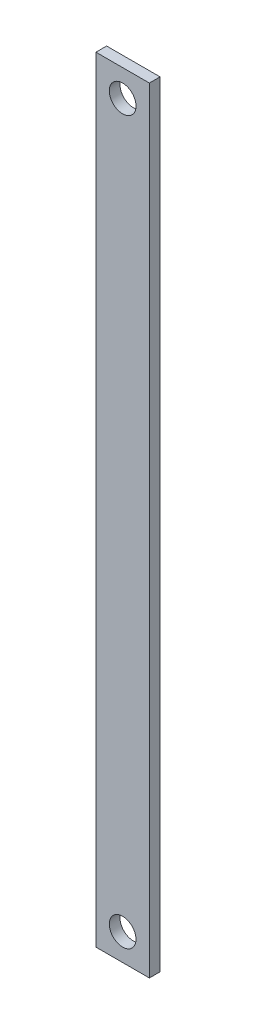
ISO-10303-21;
HEADER;
FILE_DESCRIPTION(('STEP AP214'),'2;1');
FILE_NAME('part.step','',(''),(''),'','','');
FILE_SCHEMA(('AUTOMOTIVE_DESIGN { 1 0 10303 214 1 1 1 1 }'));
ENDSEC;
DATA;
#1=APPLICATION_CONTEXT('core data for automotive mechanical design processes');
#2=APPLICATION_PROTOCOL_DEFINITION('international standard','automotive_design',2000,#1);
#3=PRODUCT_CONTEXT('',#1,'mechanical');
#4=PRODUCT('Part','Part','',(#3));
#5=PRODUCT_RELATED_PRODUCT_CATEGORY('part','',(#4));
#6=PRODUCT_DEFINITION_FORMATION('','',#4);
#7=PRODUCT_DEFINITION_CONTEXT('part definition',#1,'design');
#8=PRODUCT_DEFINITION('design','',#6,#7);
#9=PRODUCT_DEFINITION_SHAPE('','',#8);
#10=(LENGTH_UNIT() NAMED_UNIT(*) SI_UNIT(.MILLI.,.METRE.));
#11=(NAMED_UNIT(*) PLANE_ANGLE_UNIT() SI_UNIT($,.RADIAN.));
#12=(NAMED_UNIT(*) SI_UNIT($,.STERADIAN.) SOLID_ANGLE_UNIT());
#13=UNCERTAINTY_MEASURE_WITH_UNIT(LENGTH_MEASURE(1.E-05),#10,'distance_accuracy_value','');
#14=(GEOMETRIC_REPRESENTATION_CONTEXT(3) GLOBAL_UNCERTAINTY_ASSIGNED_CONTEXT((#13)) GLOBAL_UNIT_ASSIGNED_CONTEXT((#10,
#11,#12)) REPRESENTATION_CONTEXT('',''));
#15=CARTESIAN_POINT('',(0.,0.,0.));
#16=DIRECTION('',(0.,0.,1.));
#17=DIRECTION('',(1.,0.,0.));
#18=AXIS2_PLACEMENT_3D('',#15,#16,#17);
#19=CARTESIAN_POINT('',(0.,290.,0.));
#20=DIRECTION('',(1.,0.,0.));
#21=DIRECTION('',(0.,0.,-1.));
#22=AXIS2_PLACEMENT_3D('',#19,#20,#21);
#23=PLANE('',#22);
#24=DIRECTION('',(0.,0.,1.));
#25=VECTOR('',#24,1.);
#26=CARTESIAN_POINT('',(0.,0.,0.));
#27=LINE('',#26,#25);
#28=CARTESIAN_POINT('',(0.,0.,-4.));
#29=VERTEX_POINT('',#28);
#30=CARTESIAN_POINT('',(0.,0.,0.));
#31=VERTEX_POINT('',#30);
#32=EDGE_CURVE('E97',#29,#31,#27,.T.);
#33=ORIENTED_EDGE('',*,*,#32,.T.);
#34=DIRECTION('',(0.,-1.,0.));
#35=VECTOR('',#34,1.);
#36=CARTESIAN_POINT('',(0.,290.,0.));
#37=LINE('',#36,#35);
#38=CARTESIAN_POINT('',(0.,290.,0.));
#39=VERTEX_POINT('',#38);
#40=EDGE_CURVE('E11',#39,#31,#37,.T.);
#41=ORIENTED_EDGE('',*,*,#40,.F.);
#42=DIRECTION('',(0.,0.,1.));
#43=VECTOR('',#42,1.);
#44=CARTESIAN_POINT('',(0.,290.,0.));
#45=LINE('',#44,#43);
#46=CARTESIAN_POINT('',(0.,290.,-4.));
#47=VERTEX_POINT('',#46);
#48=EDGE_CURVE('E85',#47,#39,#45,.T.);
#49=ORIENTED_EDGE('',*,*,#48,.F.);
#50=DIRECTION('',(0.,-1.,0.));
#51=VECTOR('',#50,1.);
#52=CARTESIAN_POINT('',(0.,290.,-4.));
#53=LINE('',#52,#51);
#54=EDGE_CURVE('E93',#47,#29,#53,.T.);
#55=ORIENTED_EDGE('',*,*,#54,.T.);
#56=EDGE_LOOP('',(#33,#41,#49,#55));
#57=FACE_BOUND('',#56,.T.);
#58=ADVANCED_FACE('F34',(#57),#23,.F.);
#59=CARTESIAN_POINT('',(0.,290.,0.));
#60=DIRECTION('',(0.,0.,-1.));
#61=DIRECTION('',(-1.,0.,0.));
#62=AXIS2_PLACEMENT_3D('',#59,#60,#61);
#63=PLANE('',#62);
#64=CARTESIAN_POINT('',(10.,10.,0.));
#65=DIRECTION('',(0.,0.,1.));
#66=DIRECTION('',(1.,0.,0.));
#67=AXIS2_PLACEMENT_3D('',#64,#65,#66);
#68=CIRCLE('',#67,5.);
#69=CARTESIAN_POINT('',(15.,10.,0.));
#70=VERTEX_POINT('',#69);
#71=EDGE_CURVE('E117',#70,#70,#68,.T.);
#72=ORIENTED_EDGE('',*,*,#71,.F.);
#73=EDGE_LOOP('',(#72));
#74=FACE_BOUND('',#73,.T.);
#75=CARTESIAN_POINT('',(10.,280.,0.));
#76=DIRECTION('',(0.,0.,1.));
#77=DIRECTION('',(-1.,0.,0.));
#78=AXIS2_PLACEMENT_3D('',#75,#76,#77);
#79=CIRCLE('',#78,5.);
#80=CARTESIAN_POINT('',(5.,280.,0.));
#81=VERTEX_POINT('',#80);
#82=EDGE_CURVE('E111',#81,#81,#79,.T.);
#83=ORIENTED_EDGE('',*,*,#82,.F.);
#84=EDGE_LOOP('',(#83));
#85=FACE_BOUND('',#84,.T.);
#86=DIRECTION('',(1.,0.,0.));
#87=VECTOR('',#86,1.);
#88=CARTESIAN_POINT('',(0.,0.,0.));
#89=LINE('',#88,#87);
#90=CARTESIAN_POINT('',(20.,0.,0.));
#91=VERTEX_POINT('',#90);
#92=EDGE_CURVE('E89',#31,#91,#89,.T.);
#93=ORIENTED_EDGE('',*,*,#92,.T.);
#94=DIRECTION('',(0.,-1.,0.));
#95=VECTOR('',#94,1.);
#96=CARTESIAN_POINT('',(20.,290.,0.));
#97=LINE('',#96,#95);
#98=CARTESIAN_POINT('',(20.,290.,0.));
#99=VERTEX_POINT('',#98);
#100=EDGE_CURVE('E42',#99,#91,#97,.T.);
#101=ORIENTED_EDGE('',*,*,#100,.F.);
#102=DIRECTION('',(1.,0.,0.));
#103=VECTOR('',#102,1.);
#104=CARTESIAN_POINT('',(0.,290.,0.));
#105=LINE('',#104,#103);
#106=EDGE_CURVE('E80',#39,#99,#105,.T.);
#107=ORIENTED_EDGE('',*,*,#106,.F.);
#108=ORIENTED_EDGE('',*,*,#40,.T.);
#109=EDGE_LOOP('',(#93,#101,#107,#108));
#110=FACE_BOUND('',#109,.T.);
#111=ADVANCED_FACE('F88',(#74,#85,#110),#63,.F.);
#112=CARTESIAN_POINT('',(20.,290.,0.));
#113=DIRECTION('',(-1.,0.,0.));
#114=DIRECTION('',(0.,0.,1.));
#115=AXIS2_PLACEMENT_3D('',#112,#113,#114);
#116=PLANE('',#115);
#117=DIRECTION('',(0.,0.,-1.));
#118=VECTOR('',#117,1.);
#119=CARTESIAN_POINT('',(20.,0.,0.));
#120=LINE('',#119,#118);
#121=CARTESIAN_POINT('',(20.,0.,-4.));
#122=VERTEX_POINT('',#121);
#123=EDGE_CURVE('E67',#91,#122,#120,.T.);
#124=ORIENTED_EDGE('',*,*,#123,.T.);
#125=DIRECTION('',(0.,-1.,0.));
#126=VECTOR('',#125,1.);
#127=CARTESIAN_POINT('',(20.,290.,-4.));
#128=LINE('',#127,#126);
#129=CARTESIAN_POINT('',(20.,290.,-4.));
#130=VERTEX_POINT('',#129);
#131=EDGE_CURVE('E90',#130,#122,#128,.T.);
#132=ORIENTED_EDGE('',*,*,#131,.F.);
#133=DIRECTION('',(0.,0.,-1.));
#134=VECTOR('',#133,1.);
#135=CARTESIAN_POINT('',(20.,290.,0.));
#136=LINE('',#135,#134);
#137=EDGE_CURVE('E83',#99,#130,#136,.T.);
#138=ORIENTED_EDGE('',*,*,#137,.F.);
#139=ORIENTED_EDGE('',*,*,#100,.T.);
#140=EDGE_LOOP('',(#124,#132,#138,#139));
#141=FACE_BOUND('',#140,.T.);
#142=ADVANCED_FACE('F91',(#141),#116,.F.);
#143=CARTESIAN_POINT('',(0.,290.,-4.));
#144=DIRECTION('',(0.,0.,1.));
#145=DIRECTION('',(1.,0.,0.));
#146=AXIS2_PLACEMENT_3D('',#143,#144,#145);
#147=PLANE('',#146);
#148=CARTESIAN_POINT('',(10.,10.,-4.));
#149=DIRECTION('',(0.,0.,1.));
#150=DIRECTION('',(1.,0.,0.));
#151=AXIS2_PLACEMENT_3D('',#148,#149,#150);
#152=CIRCLE('',#151,5.);
#153=CARTESIAN_POINT('',(15.,10.,-4.));
#154=VERTEX_POINT('',#153);
#155=EDGE_CURVE('E100',#154,#154,#152,.T.);
#156=ORIENTED_EDGE('',*,*,#155,.T.);
#157=EDGE_LOOP('',(#156));
#158=FACE_BOUND('',#157,.T.);
#159=CARTESIAN_POINT('',(10.,280.,-4.));
#160=DIRECTION('',(0.,0.,1.));
#161=DIRECTION('',(-1.,0.,0.));
#162=AXIS2_PLACEMENT_3D('',#159,#160,#161);
#163=CIRCLE('',#162,5.);
#164=CARTESIAN_POINT('',(5.,280.,-4.));
#165=VERTEX_POINT('',#164);
#166=EDGE_CURVE('E114',#165,#165,#163,.T.);
#167=ORIENTED_EDGE('',*,*,#166,.T.);
#168=EDGE_LOOP('',(#167));
#169=FACE_BOUND('',#168,.T.);
#170=DIRECTION('',(-1.,0.,0.));
#171=VECTOR('',#170,1.);
#172=CARTESIAN_POINT('',(0.,0.,-4.));
#173=LINE('',#172,#171);
#174=EDGE_CURVE('E73',#122,#29,#173,.T.);
#175=ORIENTED_EDGE('',*,*,#174,.T.);
#176=ORIENTED_EDGE('',*,*,#54,.F.);
#177=DIRECTION('',(-1.,0.,0.));
#178=VECTOR('',#177,1.);
#179=CARTESIAN_POINT('',(0.,290.,-4.));
#180=LINE('',#179,#178);
#181=EDGE_CURVE('E50',#130,#47,#180,.T.);
#182=ORIENTED_EDGE('',*,*,#181,.F.);
#183=ORIENTED_EDGE('',*,*,#131,.T.);
#184=EDGE_LOOP('',(#175,#176,#182,#183));
#185=FACE_BOUND('',#184,.T.);
#186=ADVANCED_FACE('F105',(#158,#169,#185),#147,.F.);
#187=CARTESIAN_POINT('',(0.,290.,0.));
#188=DIRECTION('',(0.,-1.,0.));
#189=DIRECTION('',(0.,0.,-1.));
#190=AXIS2_PLACEMENT_3D('',#187,#188,#189);
#191=PLANE('',#190);
#192=ORIENTED_EDGE('',*,*,#48,.T.);
#193=ORIENTED_EDGE('',*,*,#106,.T.);
#194=ORIENTED_EDGE('',*,*,#137,.T.);
#195=ORIENTED_EDGE('',*,*,#181,.T.);
#196=EDGE_LOOP('',(#192,#193,#194,#195));
#197=FACE_BOUND('',#196,.T.);
#198=ADVANCED_FACE('F81',(#197),#191,.F.);
#199=CARTESIAN_POINT('',(0.,0.,0.));
#200=DIRECTION('',(0.,-1.,0.));
#201=DIRECTION('',(0.,0.,-1.));
#202=AXIS2_PLACEMENT_3D('',#199,#200,#201);
#203=PLANE('',#202);
#204=ORIENTED_EDGE('',*,*,#32,.F.);
#205=ORIENTED_EDGE('',*,*,#174,.F.);
#206=ORIENTED_EDGE('',*,*,#123,.F.);
#207=ORIENTED_EDGE('',*,*,#92,.F.);
#208=EDGE_LOOP('',(#204,#205,#206,#207));
#209=FACE_BOUND('',#208,.T.);
#210=ADVANCED_FACE('F108',(#209),#203,.T.);
#211=CARTESIAN_POINT('',(10.,280.,-4.));
#212=DIRECTION('',(0.,0.,1.));
#213=DIRECTION('',(1.,0.,0.));
#214=AXIS2_PLACEMENT_3D('',#211,#212,#213);
#215=CYLINDRICAL_SURFACE('',#214,5.);
#216=ORIENTED_EDGE('',*,*,#166,.F.);
#217=EDGE_LOOP('',(#216));
#218=FACE_BOUND('',#217,.T.);
#219=ORIENTED_EDGE('',*,*,#82,.T.);
#220=EDGE_LOOP('',(#219));
#221=FACE_BOUND('',#220,.T.);
#222=ADVANCED_FACE('F128',(#218,#221),#215,.F.);
#223=CARTESIAN_POINT('',(10.,10.,-4.));
#224=DIRECTION('',(0.,0.,1.));
#225=DIRECTION('',(1.,0.,0.));
#226=AXIS2_PLACEMENT_3D('',#223,#224,#225);
#227=CYLINDRICAL_SURFACE('',#226,5.);
#228=ORIENTED_EDGE('',*,*,#155,.F.);
#229=EDGE_LOOP('',(#228));
#230=FACE_BOUND('',#229,.T.);
#231=ORIENTED_EDGE('',*,*,#71,.T.);
#232=EDGE_LOOP('',(#231));
#233=FACE_BOUND('',#232,.T.);
#234=ADVANCED_FACE('F125',(#230,#233),#227,.F.);
#235=CLOSED_SHELL('',(#58,#111,#142,#186,#198,#210,#222,#234));
#236=MANIFOLD_SOLID_BREP('B2',#235);
#237=ADVANCED_BREP_SHAPE_REPRESENTATION('',(#18,#236),#14);
#238=SHAPE_DEFINITION_REPRESENTATION(#9,#237);
ENDSEC;
END-ISO-10303-21;
